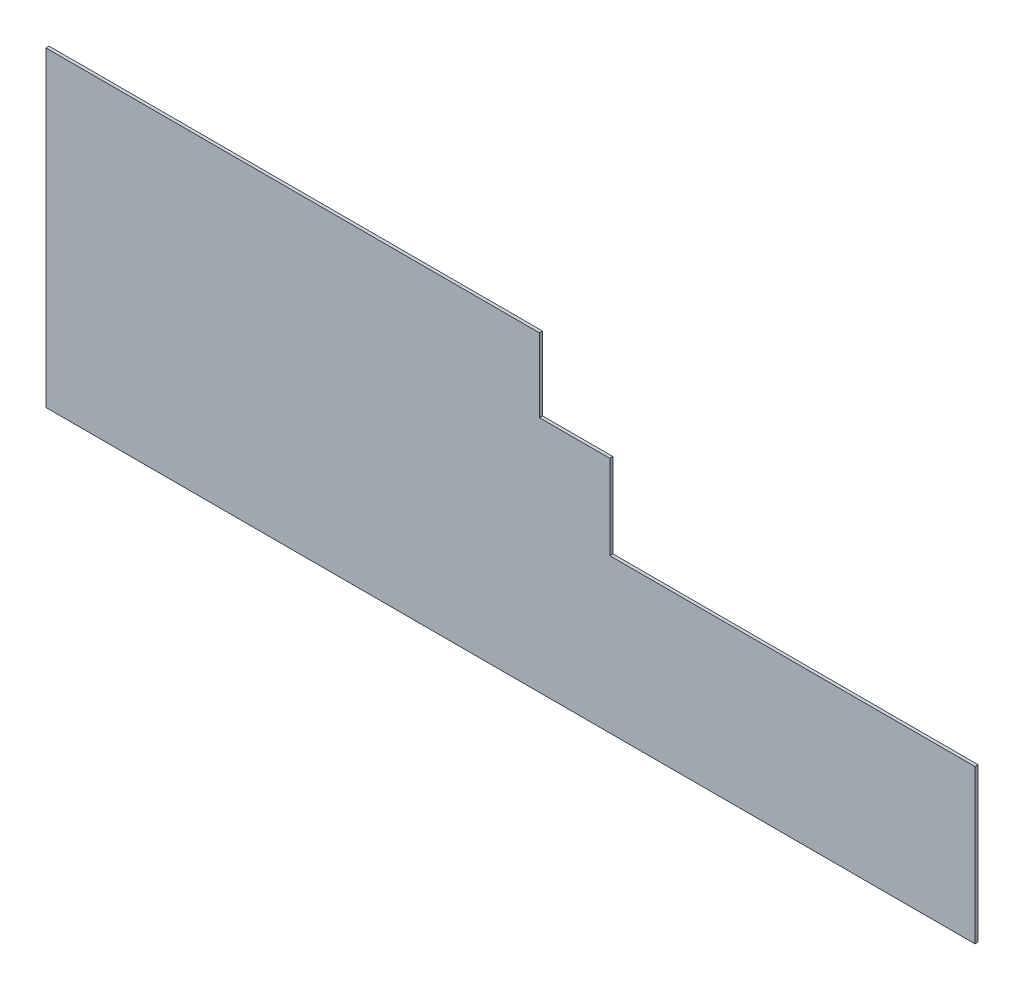
ISO-10303-21;
HEADER;
FILE_DESCRIPTION(('STEP AP214'),'2;1');
FILE_NAME('part.step','',(''),(''),'','','');
FILE_SCHEMA(('AUTOMOTIVE_DESIGN { 1 0 10303 214 1 1 1 1 }'));
ENDSEC;
DATA;
#1=APPLICATION_CONTEXT('core data for automotive mechanical design processes');
#2=APPLICATION_PROTOCOL_DEFINITION('international standard','automotive_design',2000,#1);
#3=PRODUCT_CONTEXT('',#1,'mechanical');
#4=PRODUCT('Part','Part','',(#3));
#5=PRODUCT_RELATED_PRODUCT_CATEGORY('part','',(#4));
#6=PRODUCT_DEFINITION_FORMATION('','',#4);
#7=PRODUCT_DEFINITION_CONTEXT('part definition',#1,'design');
#8=PRODUCT_DEFINITION('design','',#6,#7);
#9=PRODUCT_DEFINITION_SHAPE('','',#8);
#10=(LENGTH_UNIT() NAMED_UNIT(*) SI_UNIT(.MILLI.,.METRE.));
#11=(NAMED_UNIT(*) PLANE_ANGLE_UNIT() SI_UNIT($,.RADIAN.));
#12=(NAMED_UNIT(*) SI_UNIT($,.STERADIAN.) SOLID_ANGLE_UNIT());
#13=UNCERTAINTY_MEASURE_WITH_UNIT(LENGTH_MEASURE(1.E-05),#10,'distance_accuracy_value','');
#14=(GEOMETRIC_REPRESENTATION_CONTEXT(3) GLOBAL_UNCERTAINTY_ASSIGNED_CONTEXT((#13)) GLOBAL_UNIT_ASSIGNED_CONTEXT((#10,
#11,#12)) REPRESENTATION_CONTEXT('',''));
#15=CARTESIAN_POINT('',(0.,0.,0.));
#16=DIRECTION('',(0.,0.,1.));
#17=DIRECTION('',(1.,0.,0.));
#18=AXIS2_PLACEMENT_3D('',#15,#16,#17);
#19=CARTESIAN_POINT('',(6004.,1807.,-20.));
#20=DIRECTION('',(1.,0.,0.));
#21=DIRECTION('',(0.,0.,-1.));
#22=AXIS2_PLACEMENT_3D('',#19,#20,#21);
#23=PLANE('',#22);
#24=DIRECTION('',(0.,1.,0.));
#25=VECTOR('',#24,1.);
#26=CARTESIAN_POINT('',(6004.,1807.,-20.));
#27=LINE('',#26,#25);
#28=CARTESIAN_POINT('',(6004.,0.,-20.));
#29=VERTEX_POINT('',#28);
#30=CARTESIAN_POINT('',(6004.,993.,-20.));
#31=VERTEX_POINT('',#30);
#32=EDGE_CURVE('E132',#29,#31,#27,.T.);
#33=ORIENTED_EDGE('',*,*,#32,.T.);
#34=DIRECTION('',(0.,0.,1.));
#35=VECTOR('',#34,1.);
#36=CARTESIAN_POINT('',(6004.,993.,-20.));
#37=LINE('',#36,#35);
#38=CARTESIAN_POINT('',(6004.,993.,0.));
#39=VERTEX_POINT('',#38);
#40=EDGE_CURVE('E143',#31,#39,#37,.T.);
#41=ORIENTED_EDGE('',*,*,#40,.T.);
#42=DIRECTION('',(0.,1.,0.));
#43=VECTOR('',#42,1.);
#44=CARTESIAN_POINT('',(6004.,1807.,0.));
#45=LINE('',#44,#43);
#46=CARTESIAN_POINT('',(6004.,0.,0.));
#47=VERTEX_POINT('',#46);
#48=EDGE_CURVE('E142',#47,#39,#45,.T.);
#49=ORIENTED_EDGE('',*,*,#48,.F.);
#50=DIRECTION('',(0.,0.,1.));
#51=VECTOR('',#50,1.);
#52=CARTESIAN_POINT('',(6004.,0.,-20.));
#53=LINE('',#52,#51);
#54=EDGE_CURVE('E83',#29,#47,#53,.T.);
#55=ORIENTED_EDGE('',*,*,#54,.F.);
#56=EDGE_LOOP('',(#33,#41,#49,#55));
#57=FACE_BOUND('',#56,.T.);
#58=ADVANCED_FACE('F38',(#57),#23,.T.);
#59=CARTESIAN_POINT('',(0.,0.,-20.));
#60=DIRECTION('',(0.,0.,-1.));
#61=DIRECTION('',(-1.,0.,0.));
#62=AXIS2_PLACEMENT_3D('',#59,#60,#61);
#63=PLANE('',#62);
#64=DIRECTION('',(0.,-1.,0.));
#65=VECTOR('',#64,1.);
#66=CARTESIAN_POINT('',(3644.,-2.96928638659381E-12,-20.));
#67=LINE('',#66,#65);
#68=CARTESIAN_POINT('',(3644.,1538.,-20.));
#69=VERTEX_POINT('',#68);
#70=CARTESIAN_POINT('',(3644.,992.999999999999,-20.));
#71=VERTEX_POINT('',#70);
#72=EDGE_CURVE('E182',#69,#71,#67,.T.);
#73=ORIENTED_EDGE('',*,*,#72,.T.);
#74=DIRECTION('',(-1.,0.,0.));
#75=VECTOR('',#74,1.);
#76=CARTESIAN_POINT('',(0.,992.999999999999,-20.));
#77=LINE('',#76,#75);
#78=EDGE_CURVE('E126',#31,#71,#77,.T.);
#79=ORIENTED_EDGE('',*,*,#78,.F.);
#80=ORIENTED_EDGE('',*,*,#32,.F.);
#81=DIRECTION('',(1.,0.,0.));
#82=VECTOR('',#81,1.);
#83=CARTESIAN_POINT('',(6004.,0.,-20.));
#84=LINE('',#83,#82);
#85=CARTESIAN_POINT('',(0.,0.,-20.));
#86=VERTEX_POINT('',#85);
#87=EDGE_CURVE('E135',#86,#29,#84,.T.);
#88=ORIENTED_EDGE('',*,*,#87,.F.);
#89=DIRECTION('',(0.,-1.,0.));
#90=VECTOR('',#89,1.);
#91=CARTESIAN_POINT('',(0.,0.,-20.));
#92=LINE('',#91,#90);
#93=CARTESIAN_POINT('',(0.,2013.,-20.));
#94=VERTEX_POINT('',#93);
#95=EDGE_CURVE('E131',#94,#86,#92,.T.);
#96=ORIENTED_EDGE('',*,*,#95,.F.);
#97=DIRECTION('',(-1.,0.,0.));
#98=VECTOR('',#97,1.);
#99=CARTESIAN_POINT('',(0.,2013.,-20.));
#100=LINE('',#99,#98);
#101=CARTESIAN_POINT('',(3189.,2013.,-20.));
#102=VERTEX_POINT('',#101);
#103=EDGE_CURVE('E123',#102,#94,#100,.T.);
#104=ORIENTED_EDGE('',*,*,#103,.F.);
#105=DIRECTION('',(0.,-1.,0.));
#106=VECTOR('',#105,1.);
#107=CARTESIAN_POINT('',(3189.,-5.26468583721876E-12,-20.));
#108=LINE('',#107,#106);
#109=CARTESIAN_POINT('',(3189.,1538.,-20.));
#110=VERTEX_POINT('',#109);
#111=EDGE_CURVE('E110',#102,#110,#108,.T.);
#112=ORIENTED_EDGE('',*,*,#111,.T.);
#113=DIRECTION('',(-1.,0.,0.));
#114=VECTOR('',#113,1.);
#115=CARTESIAN_POINT('',(-3.63948066473923E-13,1538.,-20.));
#116=LINE('',#115,#114);
#117=EDGE_CURVE('E117',#69,#110,#116,.T.);
#118=ORIENTED_EDGE('',*,*,#117,.F.);
#119=EDGE_LOOP('',(#73,#79,#80,#88,#96,#104,#112,#118));
#120=FACE_BOUND('',#119,.T.);
#121=ADVANCED_FACE('F130',(#120),#63,.T.);
#122=CARTESIAN_POINT('',(0.,0.,0.));
#123=DIRECTION('',(0.,0.,-1.));
#124=DIRECTION('',(-1.,0.,0.));
#125=AXIS2_PLACEMENT_3D('',#122,#123,#124);
#126=PLANE('',#125);
#127=DIRECTION('',(1.,0.,0.));
#128=VECTOR('',#127,1.);
#129=CARTESIAN_POINT('',(0.,992.999999999999,0.));
#130=LINE('',#129,#128);
#131=CARTESIAN_POINT('',(3644.,992.999999999999,0.));
#132=VERTEX_POINT('',#131);
#133=EDGE_CURVE('E11',#132,#39,#130,.T.);
#134=ORIENTED_EDGE('',*,*,#133,.F.);
#135=DIRECTION('',(0.,1.,0.));
#136=VECTOR('',#135,1.);
#137=CARTESIAN_POINT('',(3644.,-2.96928638659381E-12,0.));
#138=LINE('',#137,#136);
#139=CARTESIAN_POINT('',(3644.,1538.,0.));
#140=VERTEX_POINT('',#139);
#141=EDGE_CURVE('E46',#132,#140,#138,.T.);
#142=ORIENTED_EDGE('',*,*,#141,.T.);
#143=DIRECTION('',(1.,0.,0.));
#144=VECTOR('',#143,1.);
#145=CARTESIAN_POINT('',(-3.63948066473923E-13,1538.,0.));
#146=LINE('',#145,#144);
#147=CARTESIAN_POINT('',(3189.,1538.,0.));
#148=VERTEX_POINT('',#147);
#149=EDGE_CURVE('E156',#148,#140,#146,.T.);
#150=ORIENTED_EDGE('',*,*,#149,.F.);
#151=DIRECTION('',(0.,1.,0.));
#152=VECTOR('',#151,1.);
#153=CARTESIAN_POINT('',(3189.,-5.26468583721876E-12,0.));
#154=LINE('',#153,#152);
#155=CARTESIAN_POINT('',(3189.,2013.,0.));
#156=VERTEX_POINT('',#155);
#157=EDGE_CURVE('E151',#148,#156,#154,.T.);
#158=ORIENTED_EDGE('',*,*,#157,.T.);
#159=DIRECTION('',(-1.,0.,0.));
#160=VECTOR('',#159,1.);
#161=CARTESIAN_POINT('',(0.,2013.,0.));
#162=LINE('',#161,#160);
#163=CARTESIAN_POINT('',(0.,2013.,0.));
#164=VERTEX_POINT('',#163);
#165=EDGE_CURVE('E125',#156,#164,#162,.T.);
#166=ORIENTED_EDGE('',*,*,#165,.T.);
#167=DIRECTION('',(0.,-1.,0.));
#168=VECTOR('',#167,1.);
#169=CARTESIAN_POINT('',(0.,0.,0.));
#170=LINE('',#169,#168);
#171=CARTESIAN_POINT('',(0.,0.,0.));
#172=VERTEX_POINT('',#171);
#173=EDGE_CURVE('E147',#164,#172,#170,.T.);
#174=ORIENTED_EDGE('',*,*,#173,.T.);
#175=DIRECTION('',(1.,0.,0.));
#176=VECTOR('',#175,1.);
#177=CARTESIAN_POINT('',(6004.,0.,0.));
#178=LINE('',#177,#176);
#179=EDGE_CURVE('E139',#172,#47,#178,.T.);
#180=ORIENTED_EDGE('',*,*,#179,.T.);
#181=ORIENTED_EDGE('',*,*,#48,.T.);
#182=EDGE_LOOP('',(#134,#142,#150,#158,#166,#174,#180,#181));
#183=FACE_BOUND('',#182,.T.);
#184=ADVANCED_FACE('F161',(#183),#126,.F.);
#185=CARTESIAN_POINT('',(6004.,0.,-20.));
#186=DIRECTION('',(0.,-1.,0.));
#187=DIRECTION('',(0.,0.,-1.));
#188=AXIS2_PLACEMENT_3D('',#185,#186,#187);
#189=PLANE('',#188);
#190=ORIENTED_EDGE('',*,*,#179,.F.);
#191=DIRECTION('',(0.,0.,1.));
#192=VECTOR('',#191,1.);
#193=CARTESIAN_POINT('',(0.,0.,-20.));
#194=LINE('',#193,#192);
#195=EDGE_CURVE('E62',#86,#172,#194,.T.);
#196=ORIENTED_EDGE('',*,*,#195,.F.);
#197=ORIENTED_EDGE('',*,*,#87,.T.);
#198=ORIENTED_EDGE('',*,*,#54,.T.);
#199=EDGE_LOOP('',(#190,#196,#197,#198));
#200=FACE_BOUND('',#199,.T.);
#201=ADVANCED_FACE('F40',(#200),#189,.T.);
#202=CARTESIAN_POINT('',(0.,0.,-20.));
#203=DIRECTION('',(-1.,0.,0.));
#204=DIRECTION('',(0.,0.,1.));
#205=AXIS2_PLACEMENT_3D('',#202,#203,#204);
#206=PLANE('',#205);
#207=ORIENTED_EDGE('',*,*,#173,.F.);
#208=DIRECTION('',(0.,0.,1.));
#209=VECTOR('',#208,1.);
#210=CARTESIAN_POINT('',(0.,2013.,-20.));
#211=LINE('',#210,#209);
#212=EDGE_CURVE('E152',#94,#164,#211,.T.);
#213=ORIENTED_EDGE('',*,*,#212,.F.);
#214=ORIENTED_EDGE('',*,*,#95,.T.);
#215=ORIENTED_EDGE('',*,*,#195,.T.);
#216=EDGE_LOOP('',(#207,#213,#214,#215));
#217=FACE_BOUND('',#216,.T.);
#218=ADVANCED_FACE('F179',(#217),#206,.T.);
#219=CARTESIAN_POINT('',(0.,2013.,-20.));
#220=DIRECTION('',(0.,1.,0.));
#221=DIRECTION('',(0.,0.,1.));
#222=AXIS2_PLACEMENT_3D('',#219,#220,#221);
#223=PLANE('',#222);
#224=DIRECTION('',(0.,0.,1.));
#225=VECTOR('',#224,1.);
#226=CARTESIAN_POINT('',(3189.,2013.,-20.));
#227=LINE('',#226,#225);
#228=EDGE_CURVE('E53',#102,#156,#227,.T.);
#229=ORIENTED_EDGE('',*,*,#228,.F.);
#230=ORIENTED_EDGE('',*,*,#103,.T.);
#231=ORIENTED_EDGE('',*,*,#212,.T.);
#232=ORIENTED_EDGE('',*,*,#165,.F.);
#233=EDGE_LOOP('',(#229,#230,#231,#232));
#234=FACE_BOUND('',#233,.T.);
#235=ADVANCED_FACE('F121',(#234),#223,.T.);
#236=CARTESIAN_POINT('',(0.,992.999999999999,-20.));
#237=DIRECTION('',(0.,1.,0.));
#238=DIRECTION('',(-1.,0.,0.));
#239=AXIS2_PLACEMENT_3D('',#236,#237,#238);
#240=PLANE('',#239);
#241=ORIENTED_EDGE('',*,*,#133,.T.);
#242=ORIENTED_EDGE('',*,*,#40,.F.);
#243=ORIENTED_EDGE('',*,*,#78,.T.);
#244=DIRECTION('',(0.,0.,1.));
#245=VECTOR('',#244,1.);
#246=CARTESIAN_POINT('',(3644.,992.999999999999,-20.));
#247=LINE('',#246,#245);
#248=EDGE_CURVE('E168',#71,#132,#247,.T.);
#249=ORIENTED_EDGE('',*,*,#248,.T.);
#250=EDGE_LOOP('',(#241,#242,#243,#249));
#251=FACE_BOUND('',#250,.T.);
#252=ADVANCED_FACE('F171',(#251),#240,.T.);
#253=CARTESIAN_POINT('',(3644.,-2.96928638659381E-12,-20.));
#254=DIRECTION('',(-1.,0.,0.));
#255=DIRECTION('',(0.,-1.,0.));
#256=AXIS2_PLACEMENT_3D('',#253,#254,#255);
#257=PLANE('',#256);
#258=ORIENTED_EDGE('',*,*,#248,.F.);
#259=ORIENTED_EDGE('',*,*,#72,.F.);
#260=DIRECTION('',(0.,0.,1.));
#261=VECTOR('',#260,1.);
#262=CARTESIAN_POINT('',(3644.,1538.,-20.));
#263=LINE('',#262,#261);
#264=EDGE_CURVE('E169',#69,#140,#263,.T.);
#265=ORIENTED_EDGE('',*,*,#264,.T.);
#266=ORIENTED_EDGE('',*,*,#141,.F.);
#267=EDGE_LOOP('',(#258,#259,#265,#266));
#268=FACE_BOUND('',#267,.T.);
#269=ADVANCED_FACE('F166',(#268),#257,.F.);
#270=CARTESIAN_POINT('',(-3.63948066473923E-13,1538.,-20.));
#271=DIRECTION('',(0.,1.,0.));
#272=DIRECTION('',(-1.,0.,0.));
#273=AXIS2_PLACEMENT_3D('',#270,#271,#272);
#274=PLANE('',#273);
#275=ORIENTED_EDGE('',*,*,#149,.T.);
#276=ORIENTED_EDGE('',*,*,#264,.F.);
#277=ORIENTED_EDGE('',*,*,#117,.T.);
#278=DIRECTION('',(0.,0.,1.));
#279=VECTOR('',#278,1.);
#280=CARTESIAN_POINT('',(3189.,1538.,-20.));
#281=LINE('',#280,#279);
#282=EDGE_CURVE('E113',#110,#148,#281,.T.);
#283=ORIENTED_EDGE('',*,*,#282,.T.);
#284=EDGE_LOOP('',(#275,#276,#277,#283));
#285=FACE_BOUND('',#284,.T.);
#286=ADVANCED_FACE('F181',(#285),#274,.T.);
#287=CARTESIAN_POINT('',(3189.,-5.26468583721876E-12,-20.));
#288=DIRECTION('',(-1.,0.,0.));
#289=DIRECTION('',(0.,-1.,0.));
#290=AXIS2_PLACEMENT_3D('',#287,#288,#289);
#291=PLANE('',#290);
#292=ORIENTED_EDGE('',*,*,#282,.F.);
#293=ORIENTED_EDGE('',*,*,#111,.F.);
#294=ORIENTED_EDGE('',*,*,#228,.T.);
#295=ORIENTED_EDGE('',*,*,#157,.F.);
#296=EDGE_LOOP('',(#292,#293,#294,#295));
#297=FACE_BOUND('',#296,.T.);
#298=ADVANCED_FACE('F111',(#297),#291,.F.);
#299=CLOSED_SHELL('',(#58,#121,#184,#201,#218,#235,#252,#269,#286,#298));
#300=MANIFOLD_SOLID_BREP('B2',#299);
#301=ADVANCED_BREP_SHAPE_REPRESENTATION('',(#18,#300),#14);
#302=SHAPE_DEFINITION_REPRESENTATION(#9,#301);
ENDSEC;
END-ISO-10303-21;
